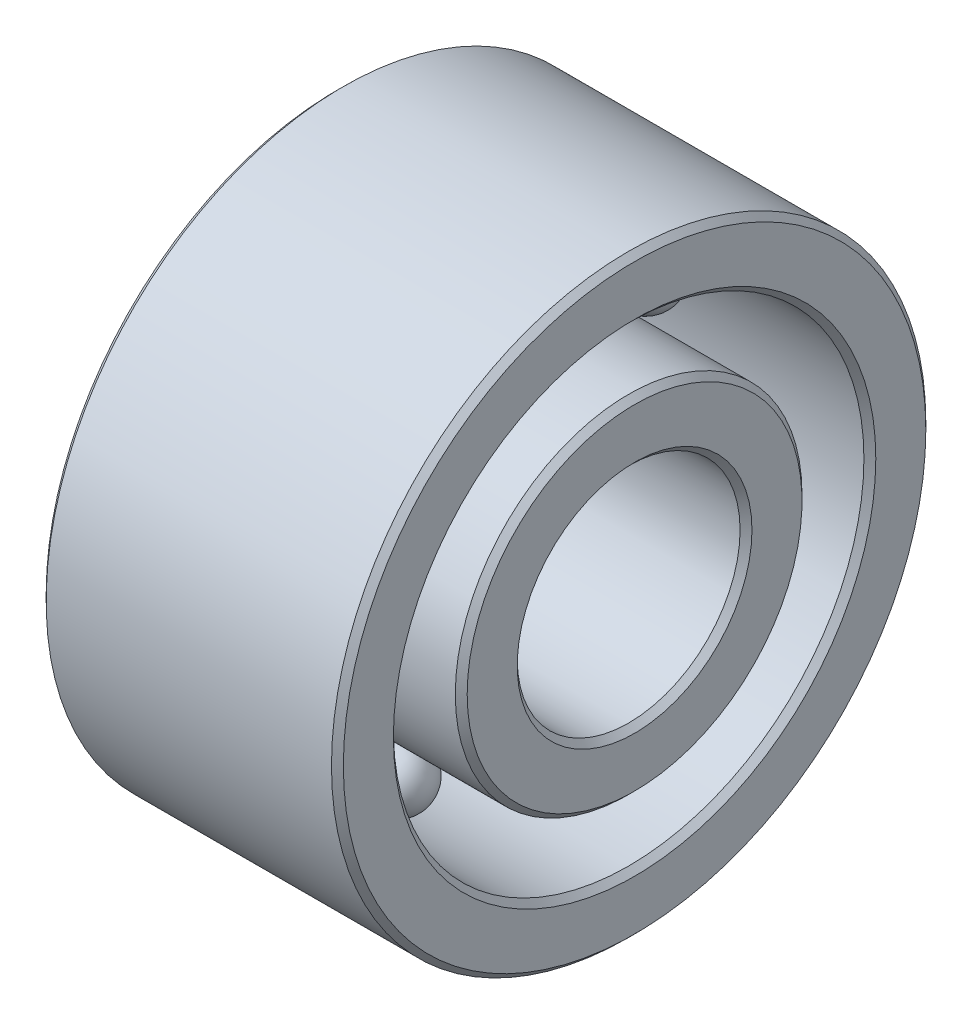
ISO-10303-21;
HEADER;
FILE_DESCRIPTION(('STEP AP214'),'2;1');
FILE_NAME('part.step','',(''),(''),'','','');
FILE_SCHEMA(('AUTOMOTIVE_DESIGN { 1 0 10303 214 1 1 1 1 }'));
ENDSEC;
DATA;
#1=APPLICATION_CONTEXT('core data for automotive mechanical design processes');
#2=APPLICATION_PROTOCOL_DEFINITION('international standard','automotive_design',2000,#1);
#3=PRODUCT_CONTEXT('',#1,'mechanical');
#4=PRODUCT('Part','Part','',(#3));
#5=PRODUCT_RELATED_PRODUCT_CATEGORY('part','',(#4));
#6=PRODUCT_DEFINITION_FORMATION('','',#4);
#7=PRODUCT_DEFINITION_CONTEXT('part definition',#1,'design');
#8=PRODUCT_DEFINITION('design','',#6,#7);
#9=PRODUCT_DEFINITION_SHAPE('','',#8);
#10=(LENGTH_UNIT() NAMED_UNIT(*) SI_UNIT(.MILLI.,.METRE.));
#11=(NAMED_UNIT(*) PLANE_ANGLE_UNIT() SI_UNIT($,.RADIAN.));
#12=(NAMED_UNIT(*) SI_UNIT($,.STERADIAN.) SOLID_ANGLE_UNIT());
#13=UNCERTAINTY_MEASURE_WITH_UNIT(LENGTH_MEASURE(1.E-05),#10,'distance_accuracy_value','');
#14=(GEOMETRIC_REPRESENTATION_CONTEXT(3) GLOBAL_UNCERTAINTY_ASSIGNED_CONTEXT((#13)) GLOBAL_UNIT_ASSIGNED_CONTEXT((#10,
#11,#12)) REPRESENTATION_CONTEXT('',''));
#15=CARTESIAN_POINT('',(0.,0.,0.));
#16=DIRECTION('',(0.,0.,1.));
#17=DIRECTION('',(1.,0.,0.));
#18=AXIS2_PLACEMENT_3D('',#15,#16,#17);
#19=CARTESIAN_POINT('',(0.999999999999999,0.,0.));
#20=DIRECTION('',(1.,0.,0.));
#21=DIRECTION('',(0.,0.,-1.));
#22=AXIS2_PLACEMENT_3D('',#19,#20,#21);
#23=CYLINDRICAL_SURFACE('',#22,3.16666666666667);
#24=CARTESIAN_POINT('',(3.91999999999371,0.,0.));
#25=DIRECTION('',(1.,0.,0.));
#26=DIRECTION('',(0.,-1.,0.));
#27=AXIS2_PLACEMENT_3D('',#24,#25,#26);
#28=CIRCLE('',#27,3.16666666668652);
#29=CARTESIAN_POINT('',(3.91999999999371,-3.16666666668652,0.));
#30=VERTEX_POINT('',#29);
#31=EDGE_CURVE('P0_E36',#30,#30,#28,.T.);
#32=ORIENTED_EDGE('',*,*,#31,.T.);
#33=EDGE_LOOP('',(#32));
#34=FACE_BOUND('',#33,.T.);
#35=CARTESIAN_POINT('',(0.0800000000253931,0.,0.));
#36=DIRECTION('',(-1.,0.,0.));
#37=DIRECTION('',(0.,-1.,0.));
#38=AXIS2_PLACEMENT_3D('',#35,#36,#37);
#39=CIRCLE('',#38,3.16666666674337);
#40=CARTESIAN_POINT('',(0.0800000000253931,-3.16666666674337,0.));
#41=VERTEX_POINT('',#40);
#42=EDGE_CURVE('P0_E33',#41,#41,#39,.T.);
#43=ORIENTED_EDGE('',*,*,#42,.T.);
#44=EDGE_LOOP('',(#43));
#45=FACE_BOUND('',#44,.T.);
#46=ADVANCED_FACE('P0_F14',(#34,#45),#23,.F.);
#47=CARTESIAN_POINT('',(4.00000000007594,0.,0.));
#48=DIRECTION('',(1.,0.,0.));
#49=DIRECTION('',(0.,0.,-1.));
#50=AXIS2_PLACEMENT_3D('',#47,#48,#49);
#51=CONICAL_SURFACE('',#50,3.24666666665507,0.785398162686906);
#52=ORIENTED_EDGE('',*,*,#31,.F.);
#53=EDGE_LOOP('',(#52));
#54=FACE_BOUND('',#53,.T.);
#55=CARTESIAN_POINT('',(4.00000000007594,0.,0.));
#56=DIRECTION('',(1.,0.,0.));
#57=DIRECTION('',(0.,0.,-1.));
#58=AXIS2_PLACEMENT_3D('',#55,#56,#57);
#59=CIRCLE('',#58,3.24666666665507);
#60=CARTESIAN_POINT('',(4.00000000007594,0.,-3.24666666665507));
#61=VERTEX_POINT('',#60);
#62=EDGE_CURVE('P0_E17',#61,#61,#59,.F.);
#63=ORIENTED_EDGE('',*,*,#62,.F.);
#64=EDGE_LOOP('',(#63));
#65=FACE_BOUND('',#64,.T.);
#66=ADVANCED_FACE('P0_F57',(#54,#65),#51,.F.);
#67=CARTESIAN_POINT('',(0.,0.,0.));
#68=DIRECTION('',(-1.,0.,0.));
#69=DIRECTION('',(0.,0.,1.));
#70=AXIS2_PLACEMENT_3D('',#67,#68,#69);
#71=CONICAL_SURFACE('',#70,3.24666666659823,0.785398162331634);
#72=CARTESIAN_POINT('',(0.,0.,0.));
#73=DIRECTION('',(-1.,0.,0.));
#74=DIRECTION('',(0.,0.,1.));
#75=AXIS2_PLACEMENT_3D('',#72,#73,#74);
#76=CIRCLE('',#75,3.24666666659823);
#77=CARTESIAN_POINT('',(0.,0.,3.24666666659823));
#78=VERTEX_POINT('',#77);
#79=EDGE_CURVE('P0_E47',#78,#78,#76,.F.);
#80=ORIENTED_EDGE('',*,*,#79,.F.);
#81=EDGE_LOOP('',(#80));
#82=FACE_BOUND('',#81,.T.);
#83=ORIENTED_EDGE('',*,*,#42,.F.);
#84=EDGE_LOOP('',(#83));
#85=FACE_BOUND('',#84,.T.);
#86=ADVANCED_FACE('P0_F59',(#82,#85),#71,.F.);
#87=CARTESIAN_POINT('',(4.,3.58333333333334,0.));
#88=DIRECTION('',(1.,0.,0.));
#89=DIRECTION('',(0.,0.,-1.));
#90=AXIS2_PLACEMENT_3D('',#87,#88,#89);
#91=PLANE('',#90);
#92=ORIENTED_EDGE('',*,*,#62,.T.);
#93=EDGE_LOOP('',(#92));
#94=FACE_BOUND('',#93,.T.);
#95=CARTESIAN_POINT('',(4.0000000000191,0.,0.));
#96=DIRECTION('',(-1.,0.,0.));
#97=DIRECTION('',(0.,0.,1.));
#98=AXIS2_PLACEMENT_3D('',#95,#96,#97);
#99=CIRCLE('',#98,3.92000000005055);
#100=CARTESIAN_POINT('',(4.0000000000191,0.,3.92000000005055));
#101=VERTEX_POINT('',#100);
#102=EDGE_CURVE('P0_E45',#101,#101,#99,.T.);
#103=ORIENTED_EDGE('',*,*,#102,.F.);
#104=EDGE_LOOP('',(#103));
#105=FACE_BOUND('',#104,.T.);
#106=ADVANCED_FACE('P0_F54',(#94,#105),#91,.T.);
#107=CARTESIAN_POINT('',(0.,3.58333333333334,0.));
#108=DIRECTION('',(-1.,0.,0.));
#109=DIRECTION('',(0.,0.,1.));
#110=AXIS2_PLACEMENT_3D('',#107,#108,#109);
#111=PLANE('',#110);
#112=ORIENTED_EDGE('',*,*,#79,.T.);
#113=EDGE_LOOP('',(#112));
#114=FACE_BOUND('',#113,.T.);
#115=CARTESIAN_POINT('',(0.,0.,0.));
#116=DIRECTION('',(1.,0.,0.));
#117=DIRECTION('',(0.,0.,-1.));
#118=AXIS2_PLACEMENT_3D('',#115,#116,#117);
#119=CIRCLE('',#118,3.92000000005055);
#120=CARTESIAN_POINT('',(0.,0.,-3.92000000005055));
#121=VERTEX_POINT('',#120);
#122=EDGE_CURVE('P0_E26',#121,#121,#119,.T.);
#123=ORIENTED_EDGE('',*,*,#122,.F.);
#124=EDGE_LOOP('',(#123));
#125=FACE_BOUND('',#124,.T.);
#126=ADVANCED_FACE('P0_F84',(#114,#125),#111,.T.);
#127=CARTESIAN_POINT('',(3.92000000010739,0.,0.));
#128=DIRECTION('',(-1.,0.,0.));
#129=DIRECTION('',(0.,0.,1.));
#130=AXIS2_PLACEMENT_3D('',#127,#128,#129);
#131=CONICAL_SURFACE('',#130,3.99999999979173,0.785398162331634);
#132=ORIENTED_EDGE('',*,*,#102,.T.);
#133=EDGE_LOOP('',(#132));
#134=FACE_BOUND('',#133,.T.);
#135=CARTESIAN_POINT('',(3.92,0.,0.));
#136=DIRECTION('',(1.,0.,0.));
#137=DIRECTION('',(0.,0.,-1.));
#138=AXIS2_PLACEMENT_3D('',#135,#136,#137);
#139=CIRCLE('',#138,4.);
#140=CARTESIAN_POINT('',(3.92,0.,-4.));
#141=VERTEX_POINT('',#140);
#142=EDGE_CURVE('P0_E21',#141,#141,#139,.F.);
#143=ORIENTED_EDGE('',*,*,#142,.F.);
#144=EDGE_LOOP('',(#143));
#145=FACE_BOUND('',#144,.T.);
#146=ADVANCED_FACE('P0_F77',(#134,#145),#131,.T.);
#147=CARTESIAN_POINT('',(0.0800000000822365,0.,0.));
#148=DIRECTION('',(1.,0.,0.));
#149=DIRECTION('',(0.,0.,-1.));
#150=AXIS2_PLACEMENT_3D('',#147,#148,#149);
#151=CONICAL_SURFACE('',#150,3.99999999996226,0.785398162331634);
#152=CARTESIAN_POINT('',(0.08,0.,0.));
#153=DIRECTION('',(1.,0.,0.));
#154=DIRECTION('',(0.,0.,-1.));
#155=AXIS2_PLACEMENT_3D('',#152,#153,#154);
#156=CIRCLE('',#155,4.);
#157=CARTESIAN_POINT('',(0.08,0.,-4.));
#158=VERTEX_POINT('',#157);
#159=EDGE_CURVE('P0_E10',#158,#158,#156,.T.);
#160=ORIENTED_EDGE('',*,*,#159,.F.);
#161=EDGE_LOOP('',(#160));
#162=FACE_BOUND('',#161,.T.);
#163=ORIENTED_EDGE('',*,*,#122,.T.);
#164=EDGE_LOOP('',(#163));
#165=FACE_BOUND('',#164,.T.);
#166=ADVANCED_FACE('P0_F72',(#162,#165),#151,.T.);
#167=CARTESIAN_POINT('',(2.,0.,0.));
#168=DIRECTION('',(1.,0.,0.));
#169=DIRECTION('',(0.,0.,-1.));
#170=AXIS2_PLACEMENT_3D('',#167,#168,#169);
#171=CYLINDRICAL_SURFACE('',#170,4.);
#172=ORIENTED_EDGE('',*,*,#159,.T.);
#173=EDGE_LOOP('',(#172));
#174=FACE_BOUND('',#173,.T.);
#175=ORIENTED_EDGE('',*,*,#142,.T.);
#176=EDGE_LOOP('',(#175));
#177=FACE_BOUND('',#176,.T.);
#178=ADVANCED_FACE('P0_F70',(#174,#177),#171,.T.);
#179=CLOSED_SHELL('',(#46,#66,#86,#106,#126,#146,#166,#178));
#180=MANIFOLD_SOLID_BREP('P0_B1',#179);
#181=CARTESIAN_POINT('',(2.,0.,0.));
#182=DIRECTION('',(1.,0.,0.));
#183=DIRECTION('',(0.,0.,-1.));
#184=AXIS2_PLACEMENT_3D('',#181,#182,#183);
#185=CYLINDRICAL_SURFACE('',#184,1.5);
#186=CARTESIAN_POINT('',(3.91999999993686,0.,0.));
#187=DIRECTION('',(1.,0.,0.));
#188=DIRECTION('',(0.,-1.,0.));
#189=AXIS2_PLACEMENT_3D('',#186,#187,#188);
#190=CIRCLE('',#189,1.49999999996453);
#191=CARTESIAN_POINT('',(3.91999999993686,-1.49999999996453,0.));
#192=VERTEX_POINT('',#191);
#193=EDGE_CURVE('P1_E36',#192,#192,#190,.T.);
#194=ORIENTED_EDGE('',*,*,#193,.T.);
#195=EDGE_LOOP('',(#194));
#196=FACE_BOUND('',#195,.T.);
#197=CARTESIAN_POINT('',(0.0800000000822365,0.,0.));
#198=DIRECTION('',(-1.,0.,0.));
#199=DIRECTION('',(0.,-1.,0.));
#200=AXIS2_PLACEMENT_3D('',#197,#198,#199);
#201=CIRCLE('',#200,1.50000000002137);
#202=CARTESIAN_POINT('',(0.0800000000822365,-1.50000000002137,0.));
#203=VERTEX_POINT('',#202);
#204=EDGE_CURVE('P1_E33',#203,#203,#201,.T.);
#205=ORIENTED_EDGE('',*,*,#204,.T.);
#206=EDGE_LOOP('',(#205));
#207=FACE_BOUND('',#206,.T.);
#208=ADVANCED_FACE('P1_F14',(#196,#207),#185,.F.);
#209=CARTESIAN_POINT('',(3.99999999996226,0.,0.));
#210=DIRECTION('',(1.,0.,0.));
#211=DIRECTION('',(0.,0.,-1.));
#212=AXIS2_PLACEMENT_3D('',#209,#210,#211);
#213=CONICAL_SURFACE('',#212,1.57999999981939,0.785398162331634);
#214=ORIENTED_EDGE('',*,*,#193,.F.);
#215=EDGE_LOOP('',(#214));
#216=FACE_BOUND('',#215,.T.);
#217=CARTESIAN_POINT('',(4.0000000000191,0.,0.));
#218=DIRECTION('',(1.,0.,0.));
#219=DIRECTION('',(0.,0.,-1.));
#220=AXIS2_PLACEMENT_3D('',#217,#218,#219);
#221=CIRCLE('',#220,1.57999999987624);
#222=CARTESIAN_POINT('',(4.0000000000191,0.,-1.57999999987624));
#223=VERTEX_POINT('',#222);
#224=EDGE_CURVE('P1_E17',#223,#223,#221,.F.);
#225=ORIENTED_EDGE('',*,*,#224,.F.);
#226=EDGE_LOOP('',(#225));
#227=FACE_BOUND('',#226,.T.);
#228=ADVANCED_FACE('P1_F57',(#216,#227),#213,.F.);
#229=CARTESIAN_POINT('',(0.,0.,0.));
#230=DIRECTION('',(-1.,0.,0.));
#231=DIRECTION('',(0.,0.,1.));
#232=AXIS2_PLACEMENT_3D('',#229,#230,#231);
#233=CONICAL_SURFACE('',#232,1.57999999998992,0.785398162686906);
#234=CARTESIAN_POINT('',(0.,0.,0.));
#235=DIRECTION('',(-1.,0.,0.));
#236=DIRECTION('',(0.,0.,1.));
#237=AXIS2_PLACEMENT_3D('',#234,#235,#236);
#238=CIRCLE('',#237,1.57999999998992);
#239=CARTESIAN_POINT('',(0.,0.,1.57999999998992));
#240=VERTEX_POINT('',#239);
#241=EDGE_CURVE('P1_E47',#240,#240,#238,.F.);
#242=ORIENTED_EDGE('',*,*,#241,.F.);
#243=EDGE_LOOP('',(#242));
#244=FACE_BOUND('',#243,.T.);
#245=ORIENTED_EDGE('',*,*,#204,.F.);
#246=EDGE_LOOP('',(#245));
#247=FACE_BOUND('',#246,.T.);
#248=ADVANCED_FACE('P1_F59',(#244,#247),#233,.F.);
#249=CARTESIAN_POINT('',(4.,1.91666666666667,0.));
#250=DIRECTION('',(1.,0.,0.));
#251=DIRECTION('',(0.,0.,-1.));
#252=AXIS2_PLACEMENT_3D('',#249,#250,#251);
#253=PLANE('',#252);
#254=ORIENTED_EDGE('',*,*,#224,.T.);
#255=EDGE_LOOP('',(#254));
#256=FACE_BOUND('',#255,.T.);
#257=CARTESIAN_POINT('',(4.0000000000191,0.,0.));
#258=DIRECTION('',(-1.,0.,0.));
#259=DIRECTION('',(0.,0.,1.));
#260=AXIS2_PLACEMENT_3D('',#257,#258,#259);
#261=CIRCLE('',#260,2.2533333333854);
#262=CARTESIAN_POINT('',(4.0000000000191,0.,2.2533333333854));
#263=VERTEX_POINT('',#262);
#264=EDGE_CURVE('P1_E45',#263,#263,#261,.T.);
#265=ORIENTED_EDGE('',*,*,#264,.F.);
#266=EDGE_LOOP('',(#265));
#267=FACE_BOUND('',#266,.T.);
#268=ADVANCED_FACE('P1_F54',(#256,#267),#253,.T.);
#269=CARTESIAN_POINT('',(0.,1.91666666666667,0.));
#270=DIRECTION('',(-1.,0.,0.));
#271=DIRECTION('',(0.,0.,1.));
#272=AXIS2_PLACEMENT_3D('',#269,#270,#271);
#273=PLANE('',#272);
#274=ORIENTED_EDGE('',*,*,#241,.T.);
#275=EDGE_LOOP('',(#274));
#276=FACE_BOUND('',#275,.T.);
#277=CARTESIAN_POINT('',(-5.6843418860808E-11,0.,0.));
#278=DIRECTION('',(1.,0.,0.));
#279=DIRECTION('',(0.,0.,-1.));
#280=AXIS2_PLACEMENT_3D('',#277,#278,#279);
#281=CIRCLE('',#280,2.2533333333854);
#282=CARTESIAN_POINT('',(-5.6843418860808E-11,0.,-2.2533333333854));
#283=VERTEX_POINT('',#282);
#284=EDGE_CURVE('P1_E26',#283,#283,#281,.T.);
#285=ORIENTED_EDGE('',*,*,#284,.F.);
#286=EDGE_LOOP('',(#285));
#287=FACE_BOUND('',#286,.T.);
#288=ADVANCED_FACE('P1_F84',(#276,#287),#273,.T.);
#289=CARTESIAN_POINT('',(3.91999999993686,0.,0.));
#290=DIRECTION('',(-1.,0.,0.));
#291=DIRECTION('',(0.,0.,1.));
#292=AXIS2_PLACEMENT_3D('',#289,#290,#291);
#293=CONICAL_SURFACE('',#292,2.33333333329711,0.785398162331634);
#294=ORIENTED_EDGE('',*,*,#264,.T.);
#295=EDGE_LOOP('',(#294));
#296=FACE_BOUND('',#295,.T.);
#297=CARTESIAN_POINT('',(3.92,0.,0.));
#298=DIRECTION('',(1.,0.,0.));
#299=DIRECTION('',(0.,0.,-1.));
#300=AXIS2_PLACEMENT_3D('',#297,#298,#299);
#301=CIRCLE('',#300,2.33333333333333);
#302=CARTESIAN_POINT('',(3.92,0.,-2.33333333333333));
#303=VERTEX_POINT('',#302);
#304=EDGE_CURVE('P1_E21',#303,#303,#301,.F.);
#305=ORIENTED_EDGE('',*,*,#304,.F.);
#306=EDGE_LOOP('',(#305));
#307=FACE_BOUND('',#306,.T.);
#308=ADVANCED_FACE('P1_F77',(#296,#307),#293,.T.);
#309=CARTESIAN_POINT('',(0.0800000000253931,0.,0.));
#310=DIRECTION('',(1.,0.,0.));
#311=DIRECTION('',(0.,0.,-1.));
#312=AXIS2_PLACEMENT_3D('',#309,#310,#311);
#313=CONICAL_SURFACE('',#312,2.33333333335395,0.785398162686906);
#314=CARTESIAN_POINT('',(0.0800000000000002,0.,0.));
#315=DIRECTION('',(1.,0.,0.));
#316=DIRECTION('',(0.,0.,-1.));
#317=AXIS2_PLACEMENT_3D('',#314,#315,#316);
#318=CIRCLE('',#317,2.33333333333333);
#319=CARTESIAN_POINT('',(0.0800000000000002,0.,-2.33333333333333));
#320=VERTEX_POINT('',#319);
#321=EDGE_CURVE('P1_E10',#320,#320,#318,.T.);
#322=ORIENTED_EDGE('',*,*,#321,.F.);
#323=EDGE_LOOP('',(#322));
#324=FACE_BOUND('',#323,.T.);
#325=ORIENTED_EDGE('',*,*,#284,.T.);
#326=EDGE_LOOP('',(#325));
#327=FACE_BOUND('',#326,.T.);
#328=ADVANCED_FACE('P1_F72',(#324,#327),#313,.T.);
#329=CARTESIAN_POINT('',(3.,0.,0.));
#330=DIRECTION('',(1.,0.,0.));
#331=DIRECTION('',(0.,0.,-1.));
#332=AXIS2_PLACEMENT_3D('',#329,#330,#331);
#333=CYLINDRICAL_SURFACE('',#332,2.33333333333333);
#334=ORIENTED_EDGE('',*,*,#321,.T.);
#335=EDGE_LOOP('',(#334));
#336=FACE_BOUND('',#335,.T.);
#337=ORIENTED_EDGE('',*,*,#304,.T.);
#338=EDGE_LOOP('',(#337));
#339=FACE_BOUND('',#338,.T.);
#340=ADVANCED_FACE('P1_F70',(#336,#339),#333,.T.);
#341=CLOSED_SHELL('',(#208,#228,#248,#268,#288,#308,#328,#340));
#342=MANIFOLD_SOLID_BREP('P1_B1',#341);
#343=CARTESIAN_POINT('',(2.,-0.611932568379865,2.68105175850002));
#344=DIRECTION('',(1.,0.,0.));
#345=DIRECTION('',(0.,-0.222520933956314,0.974927912181824));
#346=AXIS2_PLACEMENT_3D('',#343,#344,#345);
#347=SPHERICAL_SURFACE('',#346,0.416666666666667);
#348=CARTESIAN_POINT('',(2.41666666666666,-0.611932568379865,2.68105175850002));
#349=VERTEX_POINT('',#348);
#350=VERTEX_LOOP('',#349);
#351=FACE_BOUND('',#350,.T.);
#352=CARTESIAN_POINT('',(1.58333333333333,-0.611932568379865,2.68105175850002));
#353=VERTEX_POINT('',#352);
#354=VERTEX_LOOP('',#353);
#355=FACE_BOUND('',#354,.T.);
#356=ADVANCED_FACE('P2_F15',(#351,#355),#347,.T.);
#357=OPEN_SHELL('',(#356));
#358=SHELL_BASED_SURFACE_MODEL('P2_B1',(#357));
#359=CARTESIAN_POINT('',(2.,1.71459695511152,2.15003657678708));
#360=DIRECTION('',(1.,0.,0.));
#361=DIRECTION('',(0.,0.623489801858734,0.78183148246803));
#362=AXIS2_PLACEMENT_3D('',#359,#360,#361);
#363=SPHERICAL_SURFACE('',#362,0.416666666666667);
#364=CARTESIAN_POINT('',(2.41666666666666,1.71459695511152,2.15003657678708));
#365=VERTEX_POINT('',#364);
#366=VERTEX_LOOP('',#365);
#367=FACE_BOUND('',#366,.T.);
#368=CARTESIAN_POINT('',(1.58333333333333,1.71459695511152,2.15003657678708));
#369=VERTEX_POINT('',#368);
#370=VERTEX_LOOP('',#369);
#371=FACE_BOUND('',#370,.T.);
#372=ADVANCED_FACE('P3_F15',(#367,#371),#363,.T.);
#373=OPEN_SHELL('',(#372));
#374=SHELL_BASED_SURFACE_MODEL('P3_B1',(#373));
#375=CARTESIAN_POINT('',(2.,-2.47766438673165,1.19318028257329));
#376=DIRECTION('',(1.,0.,0.));
#377=DIRECTION('',(0.,-0.900968867902419,0.433883739117558));
#378=AXIS2_PLACEMENT_3D('',#375,#376,#377);
#379=SPHERICAL_SURFACE('',#378,0.416666666666667);
#380=CARTESIAN_POINT('',(2.41666666666666,-2.47766438673165,1.19318028257329));
#381=VERTEX_POINT('',#380);
#382=VERTEX_LOOP('',#381);
#383=FACE_BOUND('',#382,.T.);
#384=CARTESIAN_POINT('',(1.58333333333333,-2.47766438673165,1.19318028257329));
#385=VERTEX_POINT('',#384);
#386=VERTEX_LOOP('',#385);
#387=FACE_BOUND('',#386,.T.);
#388=ADVANCED_FACE('P4_F15',(#383,#387),#379,.T.);
#389=OPEN_SHELL('',(#388));
#390=SHELL_BASED_SURFACE_MODEL('P4_B1',(#389));
#391=CARTESIAN_POINT('',(2.,-2.47766438673165,-1.19318028257328));
#392=DIRECTION('',(1.,0.,0.));
#393=DIRECTION('',(0.,-0.900968867902419,-0.433883739117558));
#394=AXIS2_PLACEMENT_3D('',#391,#392,#393);
#395=SPHERICAL_SURFACE('',#394,0.416666666666667);
#396=CARTESIAN_POINT('',(2.41666666666666,-2.47766438673165,-1.19318028257328));
#397=VERTEX_POINT('',#396);
#398=VERTEX_LOOP('',#397);
#399=FACE_BOUND('',#398,.T.);
#400=CARTESIAN_POINT('',(1.58333333333333,-2.47766438673165,-1.19318028257328));
#401=VERTEX_POINT('',#400);
#402=VERTEX_LOOP('',#401);
#403=FACE_BOUND('',#402,.T.);
#404=ADVANCED_FACE('P5_F15',(#399,#403),#395,.T.);
#405=OPEN_SHELL('',(#404));
#406=SHELL_BASED_SURFACE_MODEL('P5_B1',(#405));
#407=CARTESIAN_POINT('',(2.,1.71459695511152,-2.15003657678708));
#408=DIRECTION('',(1.,0.,0.));
#409=DIRECTION('',(0.,0.623489801858733,-0.78183148246803));
#410=AXIS2_PLACEMENT_3D('',#407,#408,#409);
#411=SPHERICAL_SURFACE('',#410,0.416666666666667);
#412=CARTESIAN_POINT('',(2.41666666666666,1.71459695511152,-2.15003657678708));
#413=VERTEX_POINT('',#412);
#414=VERTEX_LOOP('',#413);
#415=FACE_BOUND('',#414,.T.);
#416=CARTESIAN_POINT('',(1.58333333333333,1.71459695511152,-2.15003657678708));
#417=VERTEX_POINT('',#416);
#418=VERTEX_LOOP('',#417);
#419=FACE_BOUND('',#418,.T.);
#420=ADVANCED_FACE('P6_F15',(#415,#419),#411,.T.);
#421=OPEN_SHELL('',(#420));
#422=SHELL_BASED_SURFACE_MODEL('P6_B1',(#421));
#423=CARTESIAN_POINT('',(2.,2.75,0.));
#424=DIRECTION('',(1.,0.,0.));
#425=DIRECTION('',(0.,1.,0.));
#426=AXIS2_PLACEMENT_3D('',#423,#424,#425);
#427=SPHERICAL_SURFACE('',#426,0.416666666666667);
#428=CARTESIAN_POINT('',(2.41666666666666,2.75,0.));
#429=VERTEX_POINT('',#428);
#430=VERTEX_LOOP('',#429);
#431=FACE_BOUND('',#430,.T.);
#432=CARTESIAN_POINT('',(1.58333333333333,2.75,0.));
#433=VERTEX_POINT('',#432);
#434=VERTEX_LOOP('',#433);
#435=FACE_BOUND('',#434,.T.);
#436=ADVANCED_FACE('P7_F15',(#431,#435),#427,.T.);
#437=OPEN_SHELL('',(#436));
#438=SHELL_BASED_SURFACE_MODEL('P7_B1',(#437));
#439=CARTESIAN_POINT('',(2.,-0.611932568379865,-2.68105175850002));
#440=DIRECTION('',(1.,0.,0.));
#441=DIRECTION('',(0.,-0.222520933956315,-0.974927912181824));
#442=AXIS2_PLACEMENT_3D('',#439,#440,#441);
#443=SPHERICAL_SURFACE('',#442,0.416666666666667);
#444=CARTESIAN_POINT('',(2.41666666666666,-0.611932568379865,-2.68105175850002));
#445=VERTEX_POINT('',#444);
#446=VERTEX_LOOP('',#445);
#447=FACE_BOUND('',#446,.T.);
#448=CARTESIAN_POINT('',(1.58333333333333,-0.611932568379865,-2.68105175850002));
#449=VERTEX_POINT('',#448);
#450=VERTEX_LOOP('',#449);
#451=FACE_BOUND('',#450,.T.);
#452=ADVANCED_FACE('P8_F15',(#447,#451),#443,.T.);
#453=OPEN_SHELL('',(#452));
#454=SHELL_BASED_SURFACE_MODEL('P8_B1',(#453));
#455=ADVANCED_BREP_SHAPE_REPRESENTATION('',(#18,#180,#342),#14);
#456=MANIFOLD_SURFACE_SHAPE_REPRESENTATION('',(#18,#358,#374,#390,#406,#422,#438,#454),#14);
#457=SHAPE_REPRESENTATION('',(#18),#14);
#458=SHAPE_DEFINITION_REPRESENTATION(#9,#457);
#459=SHAPE_REPRESENTATION_RELATIONSHIP('','',#457,#455);
#460=SHAPE_REPRESENTATION_RELATIONSHIP('','',#457,#456);
ENDSEC;
END-ISO-10303-21;
